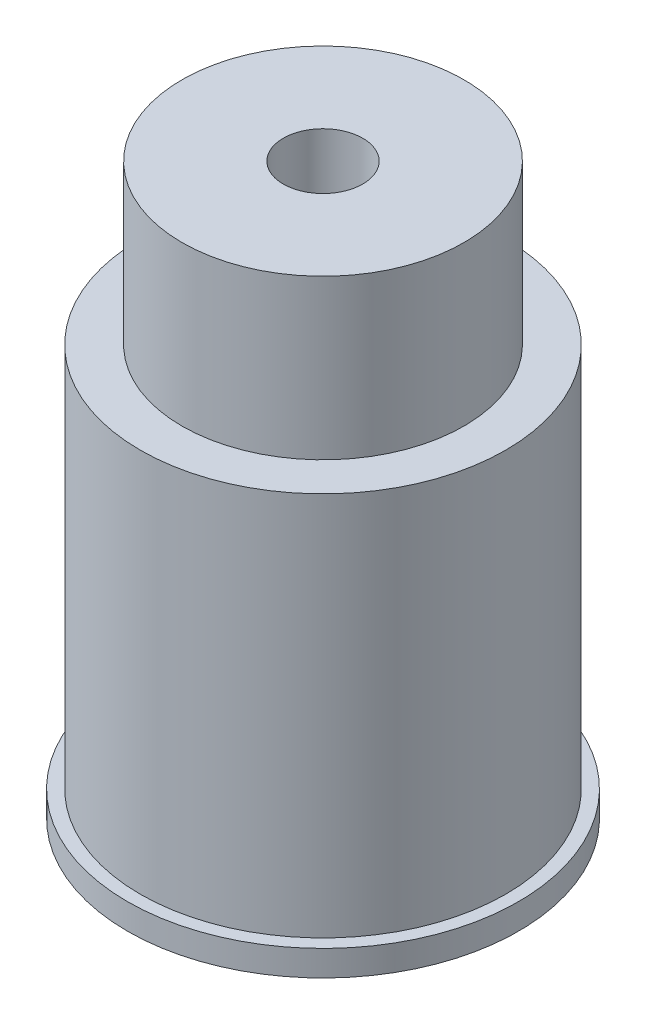
ISO-10303-21;
HEADER;
FILE_DESCRIPTION(('STEP AP214'),'2;1');
FILE_NAME('part.step','',(''),(''),'','','');
FILE_SCHEMA(('AUTOMOTIVE_DESIGN { 1 0 10303 214 1 1 1 1 }'));
ENDSEC;
DATA;
#1=APPLICATION_CONTEXT('core data for automotive mechanical design processes');
#2=APPLICATION_PROTOCOL_DEFINITION('international standard','automotive_design',2000,#1);
#3=PRODUCT_CONTEXT('',#1,'mechanical');
#4=PRODUCT('Part','Part','',(#3));
#5=PRODUCT_RELATED_PRODUCT_CATEGORY('part','',(#4));
#6=PRODUCT_DEFINITION_FORMATION('','',#4);
#7=PRODUCT_DEFINITION_CONTEXT('part definition',#1,'design');
#8=PRODUCT_DEFINITION('design','',#6,#7);
#9=PRODUCT_DEFINITION_SHAPE('','',#8);
#10=(LENGTH_UNIT() NAMED_UNIT(*) SI_UNIT(.MILLI.,.METRE.));
#11=(NAMED_UNIT(*) PLANE_ANGLE_UNIT() SI_UNIT($,.RADIAN.));
#12=(NAMED_UNIT(*) SI_UNIT($,.STERADIAN.) SOLID_ANGLE_UNIT());
#13=UNCERTAINTY_MEASURE_WITH_UNIT(LENGTH_MEASURE(1.E-05),#10,'distance_accuracy_value','');
#14=(GEOMETRIC_REPRESENTATION_CONTEXT(3) GLOBAL_UNCERTAINTY_ASSIGNED_CONTEXT((#13)) GLOBAL_UNIT_ASSIGNED_CONTEXT((#10,
#11,#12)) REPRESENTATION_CONTEXT('',''));
#15=CARTESIAN_POINT('',(0.,0.,0.));
#16=DIRECTION('',(0.,0.,1.));
#17=DIRECTION('',(1.,0.,0.));
#18=AXIS2_PLACEMENT_3D('',#15,#16,#17);
#19=CARTESIAN_POINT('',(0.,1.,0.));
#20=DIRECTION('',(0.,-1.,0.));
#21=DIRECTION('',(0.,0.,-1.));
#22=AXIS2_PLACEMENT_3D('',#19,#20,#21);
#23=CYLINDRICAL_SURFACE('',#22,7.625);
#24=CARTESIAN_POINT('',(0.,1.,0.));
#25=DIRECTION('',(0.,1.,0.));
#26=DIRECTION('',(0.,0.,1.));
#27=AXIS2_PLACEMENT_3D('',#24,#25,#26);
#28=CIRCLE('',#27,7.625);
#29=CARTESIAN_POINT('',(0.,1.,7.625));
#30=VERTEX_POINT('',#29);
#31=EDGE_CURVE('E10',#30,#30,#28,.T.);
#32=ORIENTED_EDGE('',*,*,#31,.F.);
#33=EDGE_LOOP('',(#32));
#34=FACE_BOUND('',#33,.T.);
#35=CARTESIAN_POINT('',(0.,0.,0.));
#36=DIRECTION('',(0.,1.,0.));
#37=DIRECTION('',(0.,0.,1.));
#38=AXIS2_PLACEMENT_3D('',#35,#36,#37);
#39=CIRCLE('',#38,7.625);
#40=CARTESIAN_POINT('',(0.,0.,7.625));
#41=VERTEX_POINT('',#40);
#42=EDGE_CURVE('E34',#41,#41,#39,.T.);
#43=ORIENTED_EDGE('',*,*,#42,.T.);
#44=EDGE_LOOP('',(#43));
#45=FACE_BOUND('',#44,.T.);
#46=ADVANCED_FACE('F31',(#34,#45),#23,.T.);
#47=CARTESIAN_POINT('',(0.,1.,0.));
#48=DIRECTION('',(0.,1.,0.));
#49=DIRECTION('',(0.,0.,1.));
#50=AXIS2_PLACEMENT_3D('',#47,#48,#49);
#51=PLANE('',#50);
#52=CARTESIAN_POINT('',(0.,1.,0.));
#53=DIRECTION('',(0.,1.,0.));
#54=DIRECTION('',(0.,0.,1.));
#55=AXIS2_PLACEMENT_3D('',#52,#53,#54);
#56=CIRCLE('',#55,7.125);
#57=CARTESIAN_POINT('',(0.,1.,7.125));
#58=VERTEX_POINT('',#57);
#59=EDGE_CURVE('E43',#58,#58,#56,.T.);
#60=ORIENTED_EDGE('',*,*,#59,.F.);
#61=EDGE_LOOP('',(#60));
#62=FACE_BOUND('',#61,.T.);
#63=ORIENTED_EDGE('',*,*,#31,.T.);
#64=EDGE_LOOP('',(#63));
#65=FACE_BOUND('',#64,.T.);
#66=ADVANCED_FACE('F94',(#62,#65),#51,.T.);
#67=CARTESIAN_POINT('',(0.,0.,0.));
#68=DIRECTION('',(0.,1.,0.));
#69=DIRECTION('',(0.,0.,1.));
#70=AXIS2_PLACEMENT_3D('',#67,#68,#69);
#71=PLANE('',#70);
#72=CARTESIAN_POINT('',(0.,0.,0.));
#73=DIRECTION('',(0.,1.,0.));
#74=DIRECTION('',(0.,0.,1.));
#75=AXIS2_PLACEMENT_3D('',#72,#73,#74);
#76=CIRCLE('',#75,1.55);
#77=CARTESIAN_POINT('',(0.,0.,1.55));
#78=VERTEX_POINT('',#77);
#79=EDGE_CURVE('E52',#78,#78,#76,.T.);
#80=ORIENTED_EDGE('',*,*,#79,.T.);
#81=EDGE_LOOP('',(#80));
#82=FACE_BOUND('',#81,.T.);
#83=ORIENTED_EDGE('',*,*,#42,.F.);
#84=EDGE_LOOP('',(#83));
#85=FACE_BOUND('',#84,.T.);
#86=ADVANCED_FACE('F61',(#82,#85),#71,.F.);
#87=CARTESIAN_POINT('',(0.,16.,0.));
#88=DIRECTION('',(0.,-1.,0.));
#89=DIRECTION('',(0.,0.,-1.));
#90=AXIS2_PLACEMENT_3D('',#87,#88,#89);
#91=CYLINDRICAL_SURFACE('',#90,7.125);
#92=CARTESIAN_POINT('',(0.,16.,0.));
#93=DIRECTION('',(0.,1.,0.));
#94=DIRECTION('',(0.,0.,1.));
#95=AXIS2_PLACEMENT_3D('',#92,#93,#94);
#96=CIRCLE('',#95,7.125);
#97=CARTESIAN_POINT('',(0.,16.,7.125));
#98=VERTEX_POINT('',#97);
#99=EDGE_CURVE('E41',#98,#98,#96,.T.);
#100=ORIENTED_EDGE('',*,*,#99,.F.);
#101=EDGE_LOOP('',(#100));
#102=FACE_BOUND('',#101,.T.);
#103=ORIENTED_EDGE('',*,*,#59,.T.);
#104=EDGE_LOOP('',(#103));
#105=FACE_BOUND('',#104,.T.);
#106=ADVANCED_FACE('F85',(#102,#105),#91,.T.);
#107=CARTESIAN_POINT('',(0.,16.,0.));
#108=DIRECTION('',(0.,1.,0.));
#109=DIRECTION('',(0.,0.,1.));
#110=AXIS2_PLACEMENT_3D('',#107,#108,#109);
#111=PLANE('',#110);
#112=CARTESIAN_POINT('',(0.,16.,0.));
#113=DIRECTION('',(0.,1.,0.));
#114=DIRECTION('',(0.,0.,1.));
#115=AXIS2_PLACEMENT_3D('',#112,#113,#114);
#116=CIRCLE('',#115,5.5);
#117=CARTESIAN_POINT('',(0.,16.,5.5));
#118=VERTEX_POINT('',#117);
#119=EDGE_CURVE('E49',#118,#118,#116,.T.);
#120=ORIENTED_EDGE('',*,*,#119,.F.);
#121=EDGE_LOOP('',(#120));
#122=FACE_BOUND('',#121,.T.);
#123=ORIENTED_EDGE('',*,*,#99,.T.);
#124=EDGE_LOOP('',(#123));
#125=FACE_BOUND('',#124,.T.);
#126=ADVANCED_FACE('F79',(#122,#125),#111,.T.);
#127=CARTESIAN_POINT('',(0.,22.2,0.));
#128=DIRECTION('',(0.,-1.,0.));
#129=DIRECTION('',(0.,0.,-1.));
#130=AXIS2_PLACEMENT_3D('',#127,#128,#129);
#131=CYLINDRICAL_SURFACE('',#130,5.5);
#132=CARTESIAN_POINT('',(0.,22.2,0.));
#133=DIRECTION('',(0.,1.,0.));
#134=DIRECTION('',(0.,0.,1.));
#135=AXIS2_PLACEMENT_3D('',#132,#133,#134);
#136=CIRCLE('',#135,5.5);
#137=CARTESIAN_POINT('',(0.,22.2,5.5));
#138=VERTEX_POINT('',#137);
#139=EDGE_CURVE('E46',#138,#138,#136,.T.);
#140=ORIENTED_EDGE('',*,*,#139,.F.);
#141=EDGE_LOOP('',(#140));
#142=FACE_BOUND('',#141,.T.);
#143=ORIENTED_EDGE('',*,*,#119,.T.);
#144=EDGE_LOOP('',(#143));
#145=FACE_BOUND('',#144,.T.);
#146=ADVANCED_FACE('F73',(#142,#145),#131,.T.);
#147=CARTESIAN_POINT('',(0.,22.2,0.));
#148=DIRECTION('',(0.,1.,0.));
#149=DIRECTION('',(0.,0.,1.));
#150=AXIS2_PLACEMENT_3D('',#147,#148,#149);
#151=PLANE('',#150);
#152=CARTESIAN_POINT('',(0.,22.2,0.));
#153=DIRECTION('',(0.,1.,0.));
#154=DIRECTION('',(0.,0.,1.));
#155=AXIS2_PLACEMENT_3D('',#152,#153,#154);
#156=CIRCLE('',#155,1.55);
#157=CARTESIAN_POINT('',(0.,22.2,1.55));
#158=VERTEX_POINT('',#157);
#159=EDGE_CURVE('E55',#158,#158,#156,.T.);
#160=ORIENTED_EDGE('',*,*,#159,.F.);
#161=EDGE_LOOP('',(#160));
#162=FACE_BOUND('',#161,.T.);
#163=ORIENTED_EDGE('',*,*,#139,.T.);
#164=EDGE_LOOP('',(#163));
#165=FACE_BOUND('',#164,.T.);
#166=ADVANCED_FACE('F67',(#162,#165),#151,.T.);
#167=CARTESIAN_POINT('',(0.,0.,0.));
#168=DIRECTION('',(0.,1.,0.));
#169=DIRECTION('',(0.,0.,1.));
#170=AXIS2_PLACEMENT_3D('',#167,#168,#169);
#171=CYLINDRICAL_SURFACE('',#170,1.55);
#172=ORIENTED_EDGE('',*,*,#79,.F.);
#173=EDGE_LOOP('',(#172));
#174=FACE_BOUND('',#173,.T.);
#175=ORIENTED_EDGE('',*,*,#159,.T.);
#176=EDGE_LOOP('',(#175));
#177=FACE_BOUND('',#176,.T.);
#178=ADVANCED_FACE('F64',(#174,#177),#171,.F.);
#179=CLOSED_SHELL('',(#46,#66,#86,#106,#126,#146,#166,#178));
#180=MANIFOLD_SOLID_BREP('B2',#179);
#181=ADVANCED_BREP_SHAPE_REPRESENTATION('',(#18,#180),#14);
#182=SHAPE_DEFINITION_REPRESENTATION(#9,#181);
ENDSEC;
END-ISO-10303-21;
